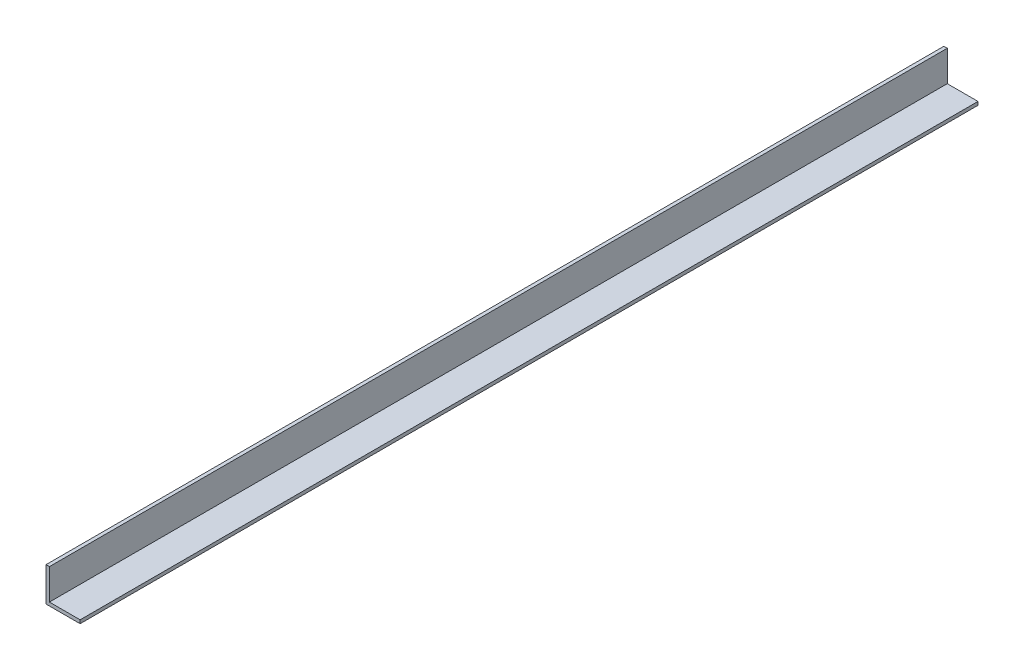
ISO-10303-21;
HEADER;
FILE_DESCRIPTION(('STEP AP214'),'2;1');
FILE_NAME('part.step','',(''),(''),'','','');
FILE_SCHEMA(('AUTOMOTIVE_DESIGN { 1 0 10303 214 1 1 1 1 }'));
ENDSEC;
DATA;
#1=APPLICATION_CONTEXT('core data for automotive mechanical design processes');
#2=APPLICATION_PROTOCOL_DEFINITION('international standard','automotive_design',2000,#1);
#3=PRODUCT_CONTEXT('',#1,'mechanical');
#4=PRODUCT('Part','Part','',(#3));
#5=PRODUCT_RELATED_PRODUCT_CATEGORY('part','',(#4));
#6=PRODUCT_DEFINITION_FORMATION('','',#4);
#7=PRODUCT_DEFINITION_CONTEXT('part definition',#1,'design');
#8=PRODUCT_DEFINITION('design','',#6,#7);
#9=PRODUCT_DEFINITION_SHAPE('','',#8);
#10=(LENGTH_UNIT() NAMED_UNIT(*) SI_UNIT(.MILLI.,.METRE.));
#11=(NAMED_UNIT(*) PLANE_ANGLE_UNIT() SI_UNIT($,.RADIAN.));
#12=(NAMED_UNIT(*) SI_UNIT($,.STERADIAN.) SOLID_ANGLE_UNIT());
#13=UNCERTAINTY_MEASURE_WITH_UNIT(LENGTH_MEASURE(1.E-05),#10,'distance_accuracy_value','');
#14=(GEOMETRIC_REPRESENTATION_CONTEXT(3) GLOBAL_UNCERTAINTY_ASSIGNED_CONTEXT((#13)) GLOBAL_UNIT_ASSIGNED_CONTEXT((#10,
#11,#12)) REPRESENTATION_CONTEXT('',''));
#15=CARTESIAN_POINT('',(0.,0.,0.));
#16=DIRECTION('',(0.,0.,1.));
#17=DIRECTION('',(1.,0.,0.));
#18=AXIS2_PLACEMENT_3D('',#15,#16,#17);
#19=CARTESIAN_POINT('',(3.8,38.,1000.));
#20=DIRECTION('',(0.,-1.,0.));
#21=DIRECTION('',(0.,0.,-1.));
#22=AXIS2_PLACEMENT_3D('',#19,#20,#21);
#23=PLANE('',#22);
#24=DIRECTION('',(-1.,0.,0.));
#25=VECTOR('',#24,1.);
#26=CARTESIAN_POINT('',(3.8,38.,0.));
#27=LINE('',#26,#25);
#28=CARTESIAN_POINT('',(3.8,38.,0.));
#29=VERTEX_POINT('',#28);
#30=CARTESIAN_POINT('',(0.,38.,0.));
#31=VERTEX_POINT('',#30);
#32=EDGE_CURVE('E118',#29,#31,#27,.T.);
#33=ORIENTED_EDGE('',*,*,#32,.T.);
#34=DIRECTION('',(0.,0.,-1.));
#35=VECTOR('',#34,1.);
#36=CARTESIAN_POINT('',(0.,38.,1000.));
#37=LINE('',#36,#35);
#38=CARTESIAN_POINT('',(0.,38.,1000.));
#39=VERTEX_POINT('',#38);
#40=EDGE_CURVE('E11',#39,#31,#37,.T.);
#41=ORIENTED_EDGE('',*,*,#40,.F.);
#42=DIRECTION('',(-1.,0.,0.));
#43=VECTOR('',#42,1.);
#44=CARTESIAN_POINT('',(3.8,38.,1000.));
#45=LINE('',#44,#43);
#46=CARTESIAN_POINT('',(3.8,38.,1000.));
#47=VERTEX_POINT('',#46);
#48=EDGE_CURVE('E128',#47,#39,#45,.T.);
#49=ORIENTED_EDGE('',*,*,#48,.F.);
#50=DIRECTION('',(0.,0.,-1.));
#51=VECTOR('',#50,1.);
#52=CARTESIAN_POINT('',(3.8,38.,1000.));
#53=LINE('',#52,#51);
#54=EDGE_CURVE('E114',#47,#29,#53,.T.);
#55=ORIENTED_EDGE('',*,*,#54,.T.);
#56=EDGE_LOOP('',(#33,#41,#49,#55));
#57=FACE_BOUND('',#56,.T.);
#58=ADVANCED_FACE('F34',(#57),#23,.F.);
#59=CARTESIAN_POINT('',(0.,38.,1000.));
#60=DIRECTION('',(1.,0.,0.));
#61=DIRECTION('',(0.,1.,0.));
#62=AXIS2_PLACEMENT_3D('',#59,#60,#61);
#63=PLANE('',#62);
#64=DIRECTION('',(0.,-1.,0.));
#65=VECTOR('',#64,1.);
#66=CARTESIAN_POINT('',(0.,38.,0.));
#67=LINE('',#66,#65);
#68=CARTESIAN_POINT('',(0.,0.,0.));
#69=VERTEX_POINT('',#68);
#70=EDGE_CURVE('E121',#31,#69,#67,.T.);
#71=ORIENTED_EDGE('',*,*,#70,.T.);
#72=DIRECTION('',(0.,0.,-1.));
#73=VECTOR('',#72,1.);
#74=CARTESIAN_POINT('',(0.,0.,1000.));
#75=LINE('',#74,#73);
#76=CARTESIAN_POINT('',(0.,0.,1000.));
#77=VERTEX_POINT('',#76);
#78=EDGE_CURVE('E42',#77,#69,#75,.T.);
#79=ORIENTED_EDGE('',*,*,#78,.F.);
#80=DIRECTION('',(0.,-1.,0.));
#81=VECTOR('',#80,1.);
#82=CARTESIAN_POINT('',(0.,38.,1000.));
#83=LINE('',#82,#81);
#84=EDGE_CURVE('E87',#39,#77,#83,.T.);
#85=ORIENTED_EDGE('',*,*,#84,.F.);
#86=ORIENTED_EDGE('',*,*,#40,.T.);
#87=EDGE_LOOP('',(#71,#79,#85,#86));
#88=FACE_BOUND('',#87,.T.);
#89=ADVANCED_FACE('F152',(#88),#63,.F.);
#90=CARTESIAN_POINT('',(0.,0.,1000.));
#91=DIRECTION('',(0.,1.,0.));
#92=DIRECTION('',(0.,0.,1.));
#93=AXIS2_PLACEMENT_3D('',#90,#91,#92);
#94=PLANE('',#93);
#95=DIRECTION('',(1.,0.,0.));
#96=VECTOR('',#95,1.);
#97=CARTESIAN_POINT('',(0.,0.,0.));
#98=LINE('',#97,#96);
#99=CARTESIAN_POINT('',(38.,0.,0.));
#100=VERTEX_POINT('',#99);
#101=EDGE_CURVE('E123',#69,#100,#98,.T.);
#102=ORIENTED_EDGE('',*,*,#101,.T.);
#103=DIRECTION('',(0.,0.,-1.));
#104=VECTOR('',#103,1.);
#105=CARTESIAN_POINT('',(38.,0.,1000.));
#106=LINE('',#105,#104);
#107=CARTESIAN_POINT('',(38.,0.,1000.));
#108=VERTEX_POINT('',#107);
#109=EDGE_CURVE('E109',#108,#100,#106,.T.);
#110=ORIENTED_EDGE('',*,*,#109,.F.);
#111=DIRECTION('',(1.,0.,0.));
#112=VECTOR('',#111,1.);
#113=CARTESIAN_POINT('',(0.,0.,1000.));
#114=LINE('',#113,#112);
#115=EDGE_CURVE('E100',#77,#108,#114,.T.);
#116=ORIENTED_EDGE('',*,*,#115,.F.);
#117=ORIENTED_EDGE('',*,*,#78,.T.);
#118=EDGE_LOOP('',(#102,#110,#116,#117));
#119=FACE_BOUND('',#118,.T.);
#120=ADVANCED_FACE('F134',(#119),#94,.F.);
#121=CARTESIAN_POINT('',(38.,0.,1000.));
#122=DIRECTION('',(-1.,0.,0.));
#123=DIRECTION('',(0.,0.,1.));
#124=AXIS2_PLACEMENT_3D('',#121,#122,#123);
#125=PLANE('',#124);
#126=DIRECTION('',(0.,1.,0.));
#127=VECTOR('',#126,1.);
#128=CARTESIAN_POINT('',(38.,0.,0.));
#129=LINE('',#128,#127);
#130=CARTESIAN_POINT('',(38.,3.8,0.));
#131=VERTEX_POINT('',#130);
#132=EDGE_CURVE('E108',#100,#131,#129,.T.);
#133=ORIENTED_EDGE('',*,*,#132,.T.);
#134=DIRECTION('',(0.,0.,-1.));
#135=VECTOR('',#134,1.);
#136=CARTESIAN_POINT('',(38.,3.8,1000.));
#137=LINE('',#136,#135);
#138=CARTESIAN_POINT('',(38.,3.8,1000.));
#139=VERTEX_POINT('',#138);
#140=EDGE_CURVE('E105',#139,#131,#137,.T.);
#141=ORIENTED_EDGE('',*,*,#140,.F.);
#142=DIRECTION('',(0.,1.,0.));
#143=VECTOR('',#142,1.);
#144=CARTESIAN_POINT('',(38.,0.,1000.));
#145=LINE('',#144,#143);
#146=EDGE_CURVE('E94',#108,#139,#145,.T.);
#147=ORIENTED_EDGE('',*,*,#146,.F.);
#148=ORIENTED_EDGE('',*,*,#109,.T.);
#149=EDGE_LOOP('',(#133,#141,#147,#148));
#150=FACE_BOUND('',#149,.T.);
#151=ADVANCED_FACE('F106',(#150),#125,.F.);
#152=CARTESIAN_POINT('',(38.,3.8,1000.));
#153=DIRECTION('',(0.,-1.,0.));
#154=DIRECTION('',(1.,0.,0.));
#155=AXIS2_PLACEMENT_3D('',#152,#153,#154);
#156=PLANE('',#155);
#157=DIRECTION('',(-1.,0.,0.));
#158=VECTOR('',#157,1.);
#159=CARTESIAN_POINT('',(38.,3.8,0.));
#160=LINE('',#159,#158);
#161=CARTESIAN_POINT('',(3.8,3.8,0.));
#162=VERTEX_POINT('',#161);
#163=EDGE_CURVE('E73',#131,#162,#160,.T.);
#164=ORIENTED_EDGE('',*,*,#163,.T.);
#165=DIRECTION('',(0.,0.,-1.));
#166=VECTOR('',#165,1.);
#167=CARTESIAN_POINT('',(3.8,3.8,1000.));
#168=LINE('',#167,#166);
#169=CARTESIAN_POINT('',(3.8,3.8,1000.));
#170=VERTEX_POINT('',#169);
#171=EDGE_CURVE('E110',#170,#162,#168,.T.);
#172=ORIENTED_EDGE('',*,*,#171,.F.);
#173=DIRECTION('',(-1.,0.,0.));
#174=VECTOR('',#173,1.);
#175=CARTESIAN_POINT('',(38.,3.8,1000.));
#176=LINE('',#175,#174);
#177=EDGE_CURVE('E98',#139,#170,#176,.T.);
#178=ORIENTED_EDGE('',*,*,#177,.F.);
#179=ORIENTED_EDGE('',*,*,#140,.T.);
#180=EDGE_LOOP('',(#164,#172,#178,#179));
#181=FACE_BOUND('',#180,.T.);
#182=ADVANCED_FACE('F112',(#181),#156,.F.);
#183=CARTESIAN_POINT('',(3.8,3.8,1000.));
#184=DIRECTION('',(-1.,0.,0.));
#185=DIRECTION('',(0.,-1.,0.));
#186=AXIS2_PLACEMENT_3D('',#183,#184,#185);
#187=PLANE('',#186);
#188=DIRECTION('',(0.,1.,0.));
#189=VECTOR('',#188,1.);
#190=CARTESIAN_POINT('',(3.8,3.8,0.));
#191=LINE('',#190,#189);
#192=EDGE_CURVE('E79',#162,#29,#191,.T.);
#193=ORIENTED_EDGE('',*,*,#192,.T.);
#194=ORIENTED_EDGE('',*,*,#54,.F.);
#195=DIRECTION('',(0.,1.,0.));
#196=VECTOR('',#195,1.);
#197=CARTESIAN_POINT('',(3.8,3.8,1000.));
#198=LINE('',#197,#196);
#199=EDGE_CURVE('E50',#170,#47,#198,.T.);
#200=ORIENTED_EDGE('',*,*,#199,.F.);
#201=ORIENTED_EDGE('',*,*,#171,.T.);
#202=EDGE_LOOP('',(#193,#194,#200,#201));
#203=FACE_BOUND('',#202,.T.);
#204=ADVANCED_FACE('F141',(#203),#187,.F.);
#205=CARTESIAN_POINT('',(0.,0.,1000.));
#206=DIRECTION('',(0.,0.,1.));
#207=DIRECTION('',(1.,0.,0.));
#208=AXIS2_PLACEMENT_3D('',#205,#206,#207);
#209=PLANE('',#208);
#210=ORIENTED_EDGE('',*,*,#48,.T.);
#211=ORIENTED_EDGE('',*,*,#84,.T.);
#212=ORIENTED_EDGE('',*,*,#115,.T.);
#213=ORIENTED_EDGE('',*,*,#146,.T.);
#214=ORIENTED_EDGE('',*,*,#177,.T.);
#215=ORIENTED_EDGE('',*,*,#199,.T.);
#216=EDGE_LOOP('',(#210,#211,#212,#213,#214,#215));
#217=FACE_BOUND('',#216,.T.);
#218=ADVANCED_FACE('F96',(#217),#209,.T.);
#219=CARTESIAN_POINT('',(0.,0.,0.));
#220=DIRECTION('',(0.,0.,1.));
#221=DIRECTION('',(1.,0.,0.));
#222=AXIS2_PLACEMENT_3D('',#219,#220,#221);
#223=PLANE('',#222);
#224=ORIENTED_EDGE('',*,*,#32,.F.);
#225=ORIENTED_EDGE('',*,*,#192,.F.);
#226=ORIENTED_EDGE('',*,*,#163,.F.);
#227=ORIENTED_EDGE('',*,*,#132,.F.);
#228=ORIENTED_EDGE('',*,*,#101,.F.);
#229=ORIENTED_EDGE('',*,*,#70,.F.);
#230=EDGE_LOOP('',(#224,#225,#226,#227,#228,#229));
#231=FACE_BOUND('',#230,.T.);
#232=ADVANCED_FACE('F137',(#231),#223,.F.);
#233=CLOSED_SHELL('',(#58,#89,#120,#151,#182,#204,#218,#232));
#234=MANIFOLD_SOLID_BREP('B2',#233);
#235=ADVANCED_BREP_SHAPE_REPRESENTATION('',(#18,#234),#14);
#236=SHAPE_DEFINITION_REPRESENTATION(#9,#235);
ENDSEC;
END-ISO-10303-21;
